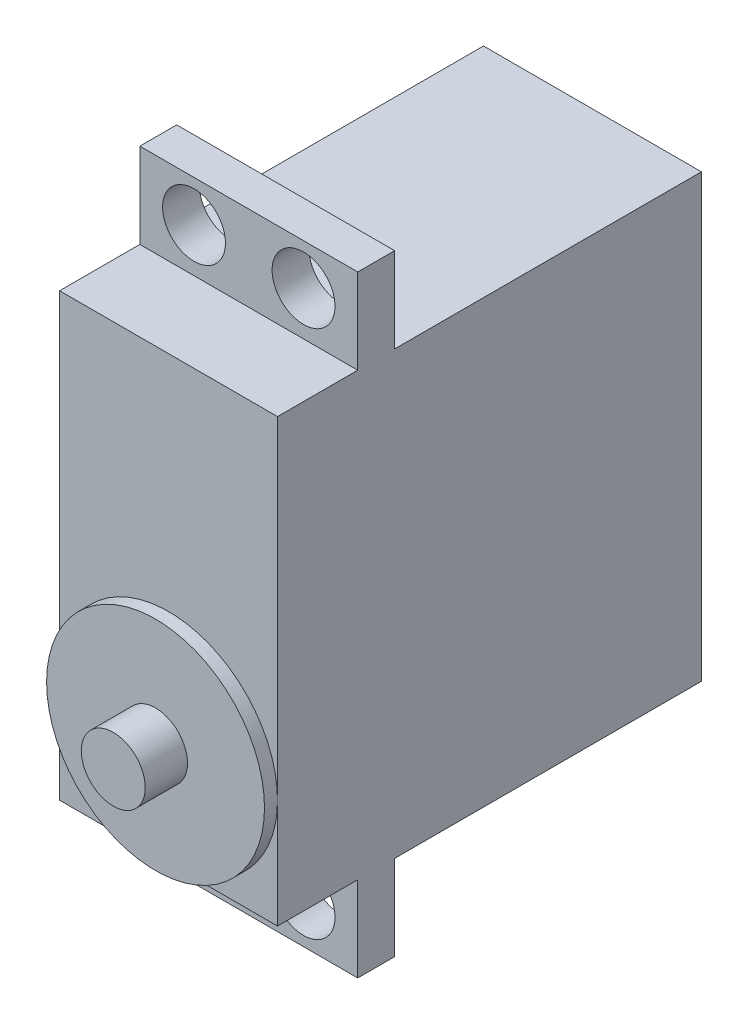
ISO-10303-21;
HEADER;
FILE_DESCRIPTION(('STEP AP214'),'2;1');
FILE_NAME('part.step','',(''),(''),'','','');
FILE_SCHEMA(('AUTOMOTIVE_DESIGN { 1 0 10303 214 1 1 1 1 }'));
ENDSEC;
DATA;
#1=APPLICATION_CONTEXT('core data for automotive mechanical design processes');
#2=APPLICATION_PROTOCOL_DEFINITION('international standard','automotive_design',2000,#1);
#3=PRODUCT_CONTEXT('',#1,'mechanical');
#4=PRODUCT('Part','Part','',(#3));
#5=PRODUCT_RELATED_PRODUCT_CATEGORY('part','',(#4));
#6=PRODUCT_DEFINITION_FORMATION('','',#4);
#7=PRODUCT_DEFINITION_CONTEXT('part definition',#1,'design');
#8=PRODUCT_DEFINITION('design','',#6,#7);
#9=PRODUCT_DEFINITION_SHAPE('','',#8);
#10=(LENGTH_UNIT() NAMED_UNIT(*) SI_UNIT(.MILLI.,.METRE.));
#11=(NAMED_UNIT(*) PLANE_ANGLE_UNIT() SI_UNIT($,.RADIAN.));
#12=(NAMED_UNIT(*) SI_UNIT($,.STERADIAN.) SOLID_ANGLE_UNIT());
#13=UNCERTAINTY_MEASURE_WITH_UNIT(LENGTH_MEASURE(1.E-05),#10,'distance_accuracy_value','');
#14=(GEOMETRIC_REPRESENTATION_CONTEXT(3) GLOBAL_UNCERTAINTY_ASSIGNED_CONTEXT((#13)) GLOBAL_UNIT_ASSIGNED_CONTEXT((#10,
#11,#12)) REPRESENTATION_CONTEXT('',''));
#15=CARTESIAN_POINT('',(0.,0.,0.));
#16=DIRECTION('',(0.,0.,1.));
#17=DIRECTION('',(1.,0.,0.));
#18=AXIS2_PLACEMENT_3D('',#15,#16,#17);
#19=CARTESIAN_POINT('',(-10.05,20.35,0.));
#20=DIRECTION('',(0.,1.,0.));
#21=DIRECTION('',(0.,0.,1.));
#22=AXIS2_PLACEMENT_3D('',#19,#20,#21);
#23=PLANE('',#22);
#24=DIRECTION('',(0.,0.,-1.));
#25=VECTOR('',#24,1.);
#26=CARTESIAN_POINT('',(10.05,20.35,0.));
#27=LINE('',#26,#25);
#28=CARTESIAN_POINT('',(10.05,20.35,0.));
#29=VERTEX_POINT('',#28);
#30=CARTESIAN_POINT('',(10.05,20.35,-7.4));
#31=VERTEX_POINT('',#30);
#32=EDGE_CURVE('E284',#29,#31,#27,.T.);
#33=ORIENTED_EDGE('',*,*,#32,.T.);
#34=DIRECTION('',(-1.,0.,0.));
#35=VECTOR('',#34,1.);
#36=CARTESIAN_POINT('',(0.,20.35,-7.4));
#37=LINE('',#36,#35);
#38=CARTESIAN_POINT('',(-10.05,20.35,-7.4));
#39=VERTEX_POINT('',#38);
#40=EDGE_CURVE('E184',#31,#39,#37,.T.);
#41=ORIENTED_EDGE('',*,*,#40,.T.);
#42=DIRECTION('',(0.,0.,-1.));
#43=VECTOR('',#42,1.);
#44=CARTESIAN_POINT('',(-10.05,20.35,0.));
#45=LINE('',#44,#43);
#46=CARTESIAN_POINT('',(-10.05,20.35,0.));
#47=VERTEX_POINT('',#46);
#48=EDGE_CURVE('E347',#47,#39,#45,.T.);
#49=ORIENTED_EDGE('',*,*,#48,.F.);
#50=DIRECTION('',(1.,0.,0.));
#51=VECTOR('',#50,1.);
#52=CARTESIAN_POINT('',(-10.05,20.35,0.));
#53=LINE('',#52,#51);
#54=EDGE_CURVE('E295',#47,#29,#53,.T.);
#55=ORIENTED_EDGE('',*,*,#54,.T.);
#56=EDGE_LOOP('',(#33,#41,#49,#55));
#57=FACE_BOUND('',#56,.T.);
#58=ADVANCED_FACE('F74',(#57),#23,.T.);
#59=CARTESIAN_POINT('',(-10.05,20.35,-10.8));
#60=VERTEX_POINT('',#59);
#61=CARTESIAN_POINT('',(-10.05,20.35,-39.1));
#62=VERTEX_POINT('',#61);
#63=EDGE_CURVE('E300',#60,#62,#45,.T.);
#64=ORIENTED_EDGE('',*,*,#63,.F.);
#65=DIRECTION('',(1.,0.,0.));
#66=VECTOR('',#65,1.);
#67=CARTESIAN_POINT('',(0.,20.35,-10.8));
#68=LINE('',#67,#66);
#69=CARTESIAN_POINT('',(10.05,20.35,-10.8));
#70=VERTEX_POINT('',#69);
#71=EDGE_CURVE('E201',#60,#70,#68,.T.);
#72=ORIENTED_EDGE('',*,*,#71,.T.);
#73=CARTESIAN_POINT('',(10.05,20.35,-39.1));
#74=VERTEX_POINT('',#73);
#75=EDGE_CURVE('E78',#70,#74,#27,.T.);
#76=ORIENTED_EDGE('',*,*,#75,.T.);
#77=DIRECTION('',(1.,0.,0.));
#78=VECTOR('',#77,1.);
#79=CARTESIAN_POINT('',(-10.05,20.35,-39.1));
#80=LINE('',#79,#78);
#81=EDGE_CURVE('E291',#62,#74,#80,.T.);
#82=ORIENTED_EDGE('',*,*,#81,.F.);
#83=EDGE_LOOP('',(#64,#72,#76,#82));
#84=FACE_BOUND('',#83,.T.);
#85=ADVANCED_FACE('F343',(#84),#23,.T.);
#86=CARTESIAN_POINT('',(-10.05,-20.35,0.));
#87=DIRECTION('',(0.,1.,0.));
#88=DIRECTION('',(0.,0.,1.));
#89=AXIS2_PLACEMENT_3D('',#86,#87,#88);
#90=PLANE('',#89);
#91=DIRECTION('',(-1.,0.,0.));
#92=VECTOR('',#91,1.);
#93=CARTESIAN_POINT('',(0.,-20.35,-7.4));
#94=LINE('',#93,#92);
#95=CARTESIAN_POINT('',(10.05,-20.35,-7.4));
#96=VERTEX_POINT('',#95);
#97=CARTESIAN_POINT('',(-10.05,-20.35,-7.4));
#98=VERTEX_POINT('',#97);
#99=EDGE_CURVE('E187',#96,#98,#94,.T.);
#100=ORIENTED_EDGE('',*,*,#99,.F.);
#101=DIRECTION('',(0.,0.,-1.));
#102=VECTOR('',#101,1.);
#103=CARTESIAN_POINT('',(10.05,-20.35,0.));
#104=LINE('',#103,#102);
#105=CARTESIAN_POINT('',(10.05,-20.35,0.));
#106=VERTEX_POINT('',#105);
#107=EDGE_CURVE('E259',#106,#96,#104,.T.);
#108=ORIENTED_EDGE('',*,*,#107,.F.);
#109=DIRECTION('',(1.,0.,0.));
#110=VECTOR('',#109,1.);
#111=CARTESIAN_POINT('',(-10.05,-20.35,0.));
#112=LINE('',#111,#110);
#113=CARTESIAN_POINT('',(0.,-20.35,0.));
#114=VERTEX_POINT('',#113);
#115=EDGE_CURVE('E270',#114,#106,#112,.T.);
#116=ORIENTED_EDGE('',*,*,#115,.F.);
#117=CARTESIAN_POINT('',(-10.05,-20.35,0.));
#118=VERTEX_POINT('',#117);
#119=EDGE_CURVE('E260',#118,#114,#112,.T.);
#120=ORIENTED_EDGE('',*,*,#119,.F.);
#121=DIRECTION('',(0.,0.,-1.));
#122=VECTOR('',#121,1.);
#123=CARTESIAN_POINT('',(-10.05,-20.35,0.));
#124=LINE('',#123,#122);
#125=EDGE_CURVE('E319',#118,#98,#124,.T.);
#126=ORIENTED_EDGE('',*,*,#125,.T.);
#127=EDGE_LOOP('',(#100,#108,#116,#120,#126));
#128=FACE_BOUND('',#127,.T.);
#129=ADVANCED_FACE('F315',(#128),#90,.F.);
#130=DIRECTION('',(1.,0.,0.));
#131=VECTOR('',#130,1.);
#132=CARTESIAN_POINT('',(0.,-20.35,-10.8));
#133=LINE('',#132,#131);
#134=CARTESIAN_POINT('',(-10.05,-20.35,-10.8));
#135=VERTEX_POINT('',#134);
#136=CARTESIAN_POINT('',(10.05,-20.35,-10.8));
#137=VERTEX_POINT('',#136);
#138=EDGE_CURVE('E221',#135,#137,#133,.T.);
#139=ORIENTED_EDGE('',*,*,#138,.F.);
#140=CARTESIAN_POINT('',(-10.05,-20.35,-39.1));
#141=VERTEX_POINT('',#140);
#142=EDGE_CURVE('E261',#135,#141,#124,.T.);
#143=ORIENTED_EDGE('',*,*,#142,.T.);
#144=DIRECTION('',(1.,0.,0.));
#145=VECTOR('',#144,1.);
#146=CARTESIAN_POINT('',(-10.05,-20.35,-39.1));
#147=LINE('',#146,#145);
#148=CARTESIAN_POINT('',(10.05,-20.35,-39.1));
#149=VERTEX_POINT('',#148);
#150=EDGE_CURVE('E273',#141,#149,#147,.T.);
#151=ORIENTED_EDGE('',*,*,#150,.T.);
#152=EDGE_CURVE('E256',#137,#149,#104,.T.);
#153=ORIENTED_EDGE('',*,*,#152,.F.);
#154=EDGE_LOOP('',(#139,#143,#151,#153));
#155=FACE_BOUND('',#154,.T.);
#156=ADVANCED_FACE('F338',(#155),#90,.F.);
#157=CARTESIAN_POINT('',(0.,0.,0.));
#158=DIRECTION('',(0.,0.,-1.));
#159=DIRECTION('',(-1.,0.,0.));
#160=AXIS2_PLACEMENT_3D('',#157,#158,#159);
#161=PLANE('',#160);
#162=CARTESIAN_POINT('',(0.,-10.3,0.));
#163=DIRECTION('',(0.,0.,1.));
#164=DIRECTION('',(1.,0.,0.));
#165=AXIS2_PLACEMENT_3D('',#162,#163,#164);
#166=CIRCLE('',#165,10.05);
#167=CARTESIAN_POINT('',(10.05,-10.3,0.));
#168=VERTEX_POINT('',#167);
#169=CARTESIAN_POINT('',(-10.05,-10.3,0.));
#170=VERTEX_POINT('',#169);
#171=EDGE_CURVE('E239',#168,#170,#166,.T.);
#172=ORIENTED_EDGE('',*,*,#171,.F.);
#173=DIRECTION('',(0.,-1.,0.));
#174=VECTOR('',#173,1.);
#175=CARTESIAN_POINT('',(10.05,20.35,0.));
#176=LINE('',#175,#174);
#177=EDGE_CURVE('E283',#29,#168,#176,.T.);
#178=ORIENTED_EDGE('',*,*,#177,.F.);
#179=ORIENTED_EDGE('',*,*,#54,.F.);
#180=DIRECTION('',(0.,-1.,0.));
#181=VECTOR('',#180,1.);
#182=CARTESIAN_POINT('',(-10.05,20.35,0.));
#183=LINE('',#182,#181);
#184=EDGE_CURVE('E359',#47,#170,#183,.T.);
#185=ORIENTED_EDGE('',*,*,#184,.T.);
#186=EDGE_LOOP('',(#172,#178,#179,#185));
#187=FACE_BOUND('',#186,.T.);
#188=ADVANCED_FACE('F358',(#187),#161,.F.);
#189=EDGE_CURVE('E84',#170,#114,#166,.T.);
#190=ORIENTED_EDGE('',*,*,#189,.F.);
#191=EDGE_CURVE('E279',#170,#118,#183,.T.);
#192=ORIENTED_EDGE('',*,*,#191,.T.);
#193=ORIENTED_EDGE('',*,*,#119,.T.);
#194=EDGE_LOOP('',(#190,#192,#193));
#195=FACE_BOUND('',#194,.T.);
#196=ADVANCED_FACE('F375',(#195),#161,.F.);
#197=CARTESIAN_POINT('',(0.,0.,-39.1));
#198=DIRECTION('',(0.,0.,-1.));
#199=DIRECTION('',(-1.,0.,0.));
#200=AXIS2_PLACEMENT_3D('',#197,#198,#199);
#201=PLANE('',#200);
#202=DIRECTION('',(0.,-1.,0.));
#203=VECTOR('',#202,1.);
#204=CARTESIAN_POINT('',(-10.05,20.35,-39.1));
#205=LINE('',#204,#203);
#206=EDGE_CURVE('E244',#62,#141,#205,.T.);
#207=ORIENTED_EDGE('',*,*,#206,.F.);
#208=ORIENTED_EDGE('',*,*,#81,.T.);
#209=DIRECTION('',(0.,-1.,0.));
#210=VECTOR('',#209,1.);
#211=CARTESIAN_POINT('',(10.05,20.35,-39.1));
#212=LINE('',#211,#210);
#213=EDGE_CURVE('E303',#74,#149,#212,.T.);
#214=ORIENTED_EDGE('',*,*,#213,.T.);
#215=ORIENTED_EDGE('',*,*,#150,.F.);
#216=EDGE_LOOP('',(#207,#208,#214,#215));
#217=FACE_BOUND('',#216,.T.);
#218=ADVANCED_FACE('F76',(#217),#201,.T.);
#219=EDGE_CURVE('E251',#114,#168,#166,.T.);
#220=ORIENTED_EDGE('',*,*,#219,.F.);
#221=ORIENTED_EDGE('',*,*,#115,.T.);
#222=EDGE_CURVE('E281',#168,#106,#176,.T.);
#223=ORIENTED_EDGE('',*,*,#222,.F.);
#224=EDGE_LOOP('',(#220,#221,#223));
#225=FACE_BOUND('',#224,.T.);
#226=ADVANCED_FACE('F354',(#225),#161,.F.);
#227=CARTESIAN_POINT('',(-10.05,20.35,0.));
#228=DIRECTION('',(1.,0.,0.));
#229=DIRECTION('',(0.,0.,-1.));
#230=AXIS2_PLACEMENT_3D('',#227,#228,#229);
#231=PLANE('',#230);
#232=ORIENTED_EDGE('',*,*,#206,.T.);
#233=ORIENTED_EDGE('',*,*,#142,.F.);
#234=DIRECTION('',(0.,1.,0.));
#235=VECTOR('',#234,1.);
#236=CARTESIAN_POINT('',(-10.05,-28.2,-10.8));
#237=LINE('',#236,#235);
#238=CARTESIAN_POINT('',(-10.05,-28.2,-10.8));
#239=VERTEX_POINT('',#238);
#240=EDGE_CURVE('E230',#239,#135,#237,.T.);
#241=ORIENTED_EDGE('',*,*,#240,.F.);
#242=DIRECTION('',(0.,0.,-1.));
#243=VECTOR('',#242,1.);
#244=CARTESIAN_POINT('',(-10.05,-28.2,0.));
#245=LINE('',#244,#243);
#246=CARTESIAN_POINT('',(-10.05,-28.2,-7.4));
#247=VERTEX_POINT('',#246);
#248=EDGE_CURVE('E223',#247,#239,#245,.T.);
#249=ORIENTED_EDGE('',*,*,#248,.F.);
#250=DIRECTION('',(0.,1.,0.));
#251=VECTOR('',#250,1.);
#252=CARTESIAN_POINT('',(-10.05,-28.2,-7.4));
#253=LINE('',#252,#251);
#254=EDGE_CURVE('E232',#247,#98,#253,.T.);
#255=ORIENTED_EDGE('',*,*,#254,.T.);
#256=ORIENTED_EDGE('',*,*,#125,.F.);
#257=ORIENTED_EDGE('',*,*,#191,.F.);
#258=ORIENTED_EDGE('',*,*,#184,.F.);
#259=ORIENTED_EDGE('',*,*,#48,.T.);
#260=DIRECTION('',(0.,-1.,0.));
#261=VECTOR('',#260,1.);
#262=CARTESIAN_POINT('',(-10.05,28.2,-7.4));
#263=LINE('',#262,#261);
#264=CARTESIAN_POINT('',(-10.05,28.2,-7.4));
#265=VERTEX_POINT('',#264);
#266=EDGE_CURVE('E210',#265,#39,#263,.T.);
#267=ORIENTED_EDGE('',*,*,#266,.F.);
#268=DIRECTION('',(0.,0.,1.));
#269=VECTOR('',#268,1.);
#270=CARTESIAN_POINT('',(-10.05,28.2,0.));
#271=LINE('',#270,#269);
#272=CARTESIAN_POINT('',(-10.05,28.2,-10.8));
#273=VERTEX_POINT('',#272);
#274=EDGE_CURVE('E199',#273,#265,#271,.T.);
#275=ORIENTED_EDGE('',*,*,#274,.F.);
#276=DIRECTION('',(0.,-1.,0.));
#277=VECTOR('',#276,1.);
#278=CARTESIAN_POINT('',(-10.05,28.2,-10.8));
#279=LINE('',#278,#277);
#280=EDGE_CURVE('E214',#273,#60,#279,.T.);
#281=ORIENTED_EDGE('',*,*,#280,.T.);
#282=ORIENTED_EDGE('',*,*,#63,.T.);
#283=EDGE_LOOP('',(#232,#233,#241,#249,#255,#256,#257,#258,#259,#267,#275,#281,#282));
#284=FACE_BOUND('',#283,.T.);
#285=ADVANCED_FACE('F325',(#284),#231,.F.);
#286=CARTESIAN_POINT('',(10.05,20.35,0.));
#287=DIRECTION('',(1.,0.,0.));
#288=DIRECTION('',(0.,0.,-1.));
#289=AXIS2_PLACEMENT_3D('',#286,#287,#288);
#290=PLANE('',#289);
#291=ORIENTED_EDGE('',*,*,#213,.F.);
#292=ORIENTED_EDGE('',*,*,#75,.F.);
#293=DIRECTION('',(0.,-1.,0.));
#294=VECTOR('',#293,1.);
#295=CARTESIAN_POINT('',(10.05,28.2,-10.8));
#296=LINE('',#295,#294);
#297=CARTESIAN_POINT('',(10.05,28.2,-10.8));
#298=VERTEX_POINT('',#297);
#299=EDGE_CURVE('E92',#298,#70,#296,.T.);
#300=ORIENTED_EDGE('',*,*,#299,.F.);
#301=DIRECTION('',(0.,0.,-1.));
#302=VECTOR('',#301,1.);
#303=CARTESIAN_POINT('',(10.05,28.2,0.));
#304=LINE('',#303,#302);
#305=CARTESIAN_POINT('',(10.05,28.2,-7.4));
#306=VERTEX_POINT('',#305);
#307=EDGE_CURVE('E189',#306,#298,#304,.T.);
#308=ORIENTED_EDGE('',*,*,#307,.F.);
#309=DIRECTION('',(0.,-1.,0.));
#310=VECTOR('',#309,1.);
#311=CARTESIAN_POINT('',(10.05,28.2,-7.4));
#312=LINE('',#311,#310);
#313=EDGE_CURVE('E178',#306,#31,#312,.T.);
#314=ORIENTED_EDGE('',*,*,#313,.T.);
#315=ORIENTED_EDGE('',*,*,#32,.F.);
#316=ORIENTED_EDGE('',*,*,#177,.T.);
#317=ORIENTED_EDGE('',*,*,#222,.T.);
#318=ORIENTED_EDGE('',*,*,#107,.T.);
#319=DIRECTION('',(0.,1.,0.));
#320=VECTOR('',#319,1.);
#321=CARTESIAN_POINT('',(10.05,-28.2,-7.4));
#322=LINE('',#321,#320);
#323=CARTESIAN_POINT('',(10.05,-28.2,-7.4));
#324=VERTEX_POINT('',#323);
#325=EDGE_CURVE('E235',#324,#96,#322,.T.);
#326=ORIENTED_EDGE('',*,*,#325,.F.);
#327=DIRECTION('',(0.,0.,1.));
#328=VECTOR('',#327,1.);
#329=CARTESIAN_POINT('',(10.05,-28.2,0.));
#330=LINE('',#329,#328);
#331=CARTESIAN_POINT('',(10.05,-28.2,-10.8));
#332=VERTEX_POINT('',#331);
#333=EDGE_CURVE('E217',#332,#324,#330,.T.);
#334=ORIENTED_EDGE('',*,*,#333,.F.);
#335=DIRECTION('',(0.,1.,0.));
#336=VECTOR('',#335,1.);
#337=CARTESIAN_POINT('',(10.05,-28.2,-10.8));
#338=LINE('',#337,#336);
#339=EDGE_CURVE('E100',#332,#137,#338,.T.);
#340=ORIENTED_EDGE('',*,*,#339,.T.);
#341=ORIENTED_EDGE('',*,*,#152,.T.);
#342=EDGE_LOOP('',(#291,#292,#300,#308,#314,#315,#316,#317,#318,#326,#334,#340,#341));
#343=FACE_BOUND('',#342,.T.);
#344=ADVANCED_FACE('F191',(#343),#290,.T.);
#345=CARTESIAN_POINT('',(0.,-10.3,1.2));
#346=DIRECTION('',(0.,0.,-1.));
#347=DIRECTION('',(-1.,0.,0.));
#348=AXIS2_PLACEMENT_3D('',#345,#346,#347);
#349=CYLINDRICAL_SURFACE('',#348,10.05);
#350=CARTESIAN_POINT('',(0.,-10.3,1.2));
#351=DIRECTION('',(0.,0.,1.));
#352=DIRECTION('',(1.,0.,0.));
#353=AXIS2_PLACEMENT_3D('',#350,#351,#352);
#354=CIRCLE('',#353,10.05);
#355=CARTESIAN_POINT('',(10.05,-10.3,1.2));
#356=VERTEX_POINT('',#355);
#357=EDGE_CURVE('E241',#356,#356,#354,.T.);
#358=ORIENTED_EDGE('',*,*,#357,.F.);
#359=EDGE_LOOP('',(#358));
#360=FACE_BOUND('',#359,.T.);
#361=ORIENTED_EDGE('',*,*,#171,.T.);
#362=ORIENTED_EDGE('',*,*,#189,.T.);
#363=ORIENTED_EDGE('',*,*,#219,.T.);
#364=EDGE_LOOP('',(#361,#362,#363));
#365=FACE_BOUND('',#364,.T.);
#366=ADVANCED_FACE('F361',(#360,#365),#349,.T.);
#367=CARTESIAN_POINT('',(0.,0.,1.2));
#368=DIRECTION('',(0.,0.,1.));
#369=DIRECTION('',(1.,0.,0.));
#370=AXIS2_PLACEMENT_3D('',#367,#368,#369);
#371=PLANE('',#370);
#372=CARTESIAN_POINT('',(0.,-10.3,1.2));
#373=DIRECTION('',(0.,0.,1.));
#374=DIRECTION('',(1.,0.,0.));
#375=AXIS2_PLACEMENT_3D('',#372,#373,#374);
#376=CIRCLE('',#375,2.95);
#377=CARTESIAN_POINT('',(2.95,-10.3,1.2));
#378=VERTEX_POINT('',#377);
#379=EDGE_CURVE('E12',#378,#378,#376,.T.);
#380=ORIENTED_EDGE('',*,*,#379,.F.);
#381=EDGE_LOOP('',(#380));
#382=FACE_BOUND('',#381,.T.);
#383=ORIENTED_EDGE('',*,*,#357,.T.);
#384=EDGE_LOOP('',(#383));
#385=FACE_BOUND('',#384,.T.);
#386=ADVANCED_FACE('F396',(#382,#385),#371,.T.);
#387=CARTESIAN_POINT('',(0.,-10.3,5.1));
#388=DIRECTION('',(0.,0.,-1.));
#389=DIRECTION('',(-1.,0.,0.));
#390=AXIS2_PLACEMENT_3D('',#387,#388,#389);
#391=CYLINDRICAL_SURFACE('',#390,2.95);
#392=CARTESIAN_POINT('',(0.,-10.3,5.1));
#393=DIRECTION('',(0.,0.,1.));
#394=DIRECTION('',(1.,0.,0.));
#395=AXIS2_PLACEMENT_3D('',#392,#393,#394);
#396=CIRCLE('',#395,2.95);
#397=CARTESIAN_POINT('',(2.95,-10.3,5.1));
#398=VERTEX_POINT('',#397);
#399=EDGE_CURVE('E237',#398,#398,#396,.T.);
#400=ORIENTED_EDGE('',*,*,#399,.F.);
#401=EDGE_LOOP('',(#400));
#402=FACE_BOUND('',#401,.T.);
#403=ORIENTED_EDGE('',*,*,#379,.T.);
#404=EDGE_LOOP('',(#403));
#405=FACE_BOUND('',#404,.T.);
#406=ADVANCED_FACE('F400',(#402,#405),#391,.T.);
#407=CARTESIAN_POINT('',(0.,-10.3,5.1));
#408=DIRECTION('',(0.,0.,1.));
#409=DIRECTION('',(1.,0.,0.));
#410=AXIS2_PLACEMENT_3D('',#407,#408,#409);
#411=PLANE('',#410);
#412=ORIENTED_EDGE('',*,*,#399,.T.);
#413=EDGE_LOOP('',(#412));
#414=FACE_BOUND('',#413,.T.);
#415=ADVANCED_FACE('F404',(#414),#411,.T.);
#416=CARTESIAN_POINT('',(0.,-28.2,-7.4));
#417=DIRECTION('',(0.,0.,-1.));
#418=DIRECTION('',(-1.,0.,0.));
#419=AXIS2_PLACEMENT_3D('',#416,#417,#418);
#420=PLANE('',#419);
#421=CARTESIAN_POINT('',(-5.05,-24.4,-7.4));
#422=DIRECTION('',(0.,0.,1.));
#423=DIRECTION('',(1.,0.,0.));
#424=AXIS2_PLACEMENT_3D('',#421,#422,#423);
#425=CIRCLE('',#424,2.9);
#426=CARTESIAN_POINT('',(-2.15,-24.4,-7.4));
#427=VERTEX_POINT('',#426);
#428=EDGE_CURVE('E460',#427,#427,#425,.T.);
#429=ORIENTED_EDGE('',*,*,#428,.F.);
#430=EDGE_LOOP('',(#429));
#431=FACE_BOUND('',#430,.T.);
#432=CARTESIAN_POINT('',(5.05,-24.4,-7.4));
#433=DIRECTION('',(0.,0.,1.));
#434=DIRECTION('',(1.,0.,0.));
#435=AXIS2_PLACEMENT_3D('',#432,#433,#434);
#436=CIRCLE('',#435,2.9);
#437=CARTESIAN_POINT('',(7.95,-24.4,-7.4));
#438=VERTEX_POINT('',#437);
#439=EDGE_CURVE('E449',#438,#438,#436,.T.);
#440=ORIENTED_EDGE('',*,*,#439,.F.);
#441=EDGE_LOOP('',(#440));
#442=FACE_BOUND('',#441,.T.);
#443=ORIENTED_EDGE('',*,*,#99,.T.);
#444=ORIENTED_EDGE('',*,*,#254,.F.);
#445=DIRECTION('',(-1.,0.,0.));
#446=VECTOR('',#445,1.);
#447=CARTESIAN_POINT('',(0.,-28.2,-7.4));
#448=LINE('',#447,#446);
#449=EDGE_CURVE('E220',#324,#247,#448,.T.);
#450=ORIENTED_EDGE('',*,*,#449,.F.);
#451=ORIENTED_EDGE('',*,*,#325,.T.);
#452=EDGE_LOOP('',(#443,#444,#450,#451));
#453=FACE_BOUND('',#452,.T.);
#454=ADVANCED_FACE('F322',(#431,#442,#453),#420,.F.);
#455=CARTESIAN_POINT('',(0.,-28.2,-10.8));
#456=DIRECTION('',(0.,0.,1.));
#457=DIRECTION('',(1.,0.,0.));
#458=AXIS2_PLACEMENT_3D('',#455,#456,#457);
#459=PLANE('',#458);
#460=CARTESIAN_POINT('',(-5.05,-24.4,-10.8));
#461=DIRECTION('',(0.,0.,1.));
#462=DIRECTION('',(1.,0.,0.));
#463=AXIS2_PLACEMENT_3D('',#460,#461,#462);
#464=CIRCLE('',#463,2.9);
#465=CARTESIAN_POINT('',(-2.15,-24.4,-10.8));
#466=VERTEX_POINT('',#465);
#467=EDGE_CURVE('E211',#466,#466,#464,.F.);
#468=ORIENTED_EDGE('',*,*,#467,.F.);
#469=EDGE_LOOP('',(#468));
#470=FACE_BOUND('',#469,.T.);
#471=CARTESIAN_POINT('',(5.05,-24.4,-10.8));
#472=DIRECTION('',(0.,0.,1.));
#473=DIRECTION('',(1.,0.,0.));
#474=AXIS2_PLACEMENT_3D('',#471,#472,#473);
#475=CIRCLE('',#474,2.9);
#476=CARTESIAN_POINT('',(7.95,-24.4,-10.8));
#477=VERTEX_POINT('',#476);
#478=EDGE_CURVE('E205',#477,#477,#475,.F.);
#479=ORIENTED_EDGE('',*,*,#478,.F.);
#480=EDGE_LOOP('',(#479));
#481=FACE_BOUND('',#480,.T.);
#482=ORIENTED_EDGE('',*,*,#138,.T.);
#483=ORIENTED_EDGE('',*,*,#339,.F.);
#484=DIRECTION('',(1.,0.,0.));
#485=VECTOR('',#484,1.);
#486=CARTESIAN_POINT('',(0.,-28.2,-10.8));
#487=LINE('',#486,#485);
#488=EDGE_CURVE('E225',#239,#332,#487,.T.);
#489=ORIENTED_EDGE('',*,*,#488,.F.);
#490=ORIENTED_EDGE('',*,*,#240,.T.);
#491=EDGE_LOOP('',(#482,#483,#489,#490));
#492=FACE_BOUND('',#491,.T.);
#493=ADVANCED_FACE('F333',(#470,#481,#492),#459,.F.);
#494=CARTESIAN_POINT('',(0.,-28.2,0.));
#495=DIRECTION('',(0.,-1.,0.));
#496=DIRECTION('',(0.,0.,-1.));
#497=AXIS2_PLACEMENT_3D('',#494,#495,#496);
#498=PLANE('',#497);
#499=ORIENTED_EDGE('',*,*,#333,.T.);
#500=ORIENTED_EDGE('',*,*,#449,.T.);
#501=ORIENTED_EDGE('',*,*,#248,.T.);
#502=ORIENTED_EDGE('',*,*,#488,.T.);
#503=EDGE_LOOP('',(#499,#500,#501,#502));
#504=FACE_BOUND('',#503,.T.);
#505=ADVANCED_FACE('F331',(#504),#498,.T.);
#506=CARTESIAN_POINT('',(0.,28.2,-7.4));
#507=DIRECTION('',(0.,0.,1.));
#508=DIRECTION('',(1.,0.,0.));
#509=AXIS2_PLACEMENT_3D('',#506,#507,#508);
#510=PLANE('',#509);
#511=CARTESIAN_POINT('',(-5.05,24.4,-7.4));
#512=DIRECTION('',(0.,0.,1.));
#513=DIRECTION('',(1.,0.,0.));
#514=AXIS2_PLACEMENT_3D('',#511,#512,#513);
#515=CIRCLE('',#514,2.9);
#516=CARTESIAN_POINT('',(-2.15,24.4,-7.4));
#517=VERTEX_POINT('',#516);
#518=EDGE_CURVE('E448',#517,#517,#515,.T.);
#519=ORIENTED_EDGE('',*,*,#518,.F.);
#520=EDGE_LOOP('',(#519));
#521=FACE_BOUND('',#520,.T.);
#522=CARTESIAN_POINT('',(5.05,24.4,-7.4));
#523=DIRECTION('',(0.,0.,1.));
#524=DIRECTION('',(1.,0.,0.));
#525=AXIS2_PLACEMENT_3D('',#522,#523,#524);
#526=CIRCLE('',#525,2.9);
#527=CARTESIAN_POINT('',(7.95,24.4,-7.4));
#528=VERTEX_POINT('',#527);
#529=EDGE_CURVE('E452',#528,#528,#526,.T.);
#530=ORIENTED_EDGE('',*,*,#529,.F.);
#531=EDGE_LOOP('',(#530));
#532=FACE_BOUND('',#531,.T.);
#533=ORIENTED_EDGE('',*,*,#40,.F.);
#534=ORIENTED_EDGE('',*,*,#313,.F.);
#535=DIRECTION('',(-1.,0.,0.));
#536=VECTOR('',#535,1.);
#537=CARTESIAN_POINT('',(0.,28.2,-7.4));
#538=LINE('',#537,#536);
#539=EDGE_CURVE('E182',#306,#265,#538,.T.);
#540=ORIENTED_EDGE('',*,*,#539,.T.);
#541=ORIENTED_EDGE('',*,*,#266,.T.);
#542=EDGE_LOOP('',(#533,#534,#540,#541));
#543=FACE_BOUND('',#542,.T.);
#544=ADVANCED_FACE('F180',(#521,#532,#543),#510,.T.);
#545=CARTESIAN_POINT('',(0.,28.2,-10.8));
#546=DIRECTION('',(0.,0.,-1.));
#547=DIRECTION('',(-1.,0.,0.));
#548=AXIS2_PLACEMENT_3D('',#545,#546,#547);
#549=PLANE('',#548);
#550=CARTESIAN_POINT('',(-5.05,24.4,-10.8));
#551=DIRECTION('',(0.,0.,-1.));
#552=DIRECTION('',(-1.,0.,0.));
#553=AXIS2_PLACEMENT_3D('',#550,#551,#552);
#554=CIRCLE('',#553,2.9);
#555=CARTESIAN_POINT('',(-7.95,24.4,-10.8));
#556=VERTEX_POINT('',#555);
#557=EDGE_CURVE('E445',#556,#556,#554,.F.);
#558=ORIENTED_EDGE('',*,*,#557,.T.);
#559=EDGE_LOOP('',(#558));
#560=FACE_BOUND('',#559,.T.);
#561=CARTESIAN_POINT('',(5.05,24.4,-10.8));
#562=DIRECTION('',(0.,0.,-1.));
#563=DIRECTION('',(-1.,0.,0.));
#564=AXIS2_PLACEMENT_3D('',#561,#562,#563);
#565=CIRCLE('',#564,2.9);
#566=CARTESIAN_POINT('',(2.15,24.4,-10.8));
#567=VERTEX_POINT('',#566);
#568=EDGE_CURVE('E457',#567,#567,#565,.F.);
#569=ORIENTED_EDGE('',*,*,#568,.T.);
#570=EDGE_LOOP('',(#569));
#571=FACE_BOUND('',#570,.T.);
#572=ORIENTED_EDGE('',*,*,#71,.F.);
#573=ORIENTED_EDGE('',*,*,#280,.F.);
#574=DIRECTION('',(1.,0.,0.));
#575=VECTOR('',#574,1.);
#576=CARTESIAN_POINT('',(0.,28.2,-10.8));
#577=LINE('',#576,#575);
#578=EDGE_CURVE('E195',#273,#298,#577,.T.);
#579=ORIENTED_EDGE('',*,*,#578,.T.);
#580=ORIENTED_EDGE('',*,*,#299,.T.);
#581=EDGE_LOOP('',(#572,#573,#579,#580));
#582=FACE_BOUND('',#581,.T.);
#583=ADVANCED_FACE('F344',(#560,#571,#582),#549,.T.);
#584=CARTESIAN_POINT('',(0.,28.2,0.));
#585=DIRECTION('',(0.,1.,0.));
#586=DIRECTION('',(0.,0.,1.));
#587=AXIS2_PLACEMENT_3D('',#584,#585,#586);
#588=PLANE('',#587);
#589=ORIENTED_EDGE('',*,*,#539,.F.);
#590=ORIENTED_EDGE('',*,*,#307,.T.);
#591=ORIENTED_EDGE('',*,*,#578,.F.);
#592=ORIENTED_EDGE('',*,*,#274,.T.);
#593=EDGE_LOOP('',(#589,#590,#591,#592));
#594=FACE_BOUND('',#593,.T.);
#595=ADVANCED_FACE('F197',(#594),#588,.T.);
#596=CARTESIAN_POINT('',(5.05,-24.4,-39.1011030776406));
#597=DIRECTION('',(0.,0.,1.));
#598=DIRECTION('',(1.,0.,0.));
#599=AXIS2_PLACEMENT_3D('',#596,#597,#598);
#600=CYLINDRICAL_SURFACE('',#599,2.9);
#601=ORIENTED_EDGE('',*,*,#439,.T.);
#602=EDGE_LOOP('',(#601));
#603=FACE_BOUND('',#602,.T.);
#604=ORIENTED_EDGE('',*,*,#478,.T.);
#605=EDGE_LOOP('',(#604));
#606=FACE_BOUND('',#605,.T.);
#607=ADVANCED_FACE('F425',(#603,#606),#600,.F.);
#608=CARTESIAN_POINT('',(-5.05,-24.4,-39.1011030776406));
#609=DIRECTION('',(0.,0.,1.));
#610=DIRECTION('',(1.,0.,0.));
#611=AXIS2_PLACEMENT_3D('',#608,#609,#610);
#612=CYLINDRICAL_SURFACE('',#611,2.9);
#613=ORIENTED_EDGE('',*,*,#428,.T.);
#614=EDGE_LOOP('',(#613));
#615=FACE_BOUND('',#614,.T.);
#616=ORIENTED_EDGE('',*,*,#467,.T.);
#617=EDGE_LOOP('',(#616));
#618=FACE_BOUND('',#617,.T.);
#619=ADVANCED_FACE('F428',(#615,#618),#612,.F.);
#620=CARTESIAN_POINT('',(5.05,24.4,-39.1011030776406));
#621=DIRECTION('',(0.,0.,1.));
#622=DIRECTION('',(1.,0.,0.));
#623=AXIS2_PLACEMENT_3D('',#620,#621,#622);
#624=CYLINDRICAL_SURFACE('',#623,2.9);
#625=ORIENTED_EDGE('',*,*,#568,.F.);
#626=EDGE_LOOP('',(#625));
#627=FACE_BOUND('',#626,.T.);
#628=ORIENTED_EDGE('',*,*,#529,.T.);
#629=EDGE_LOOP('',(#628));
#630=FACE_BOUND('',#629,.T.);
#631=ADVANCED_FACE('F432',(#627,#630),#624,.F.);
#632=CARTESIAN_POINT('',(-5.05,24.4,-39.1011030776406));
#633=DIRECTION('',(0.,0.,1.));
#634=DIRECTION('',(1.,0.,0.));
#635=AXIS2_PLACEMENT_3D('',#632,#633,#634);
#636=CYLINDRICAL_SURFACE('',#635,2.9);
#637=ORIENTED_EDGE('',*,*,#557,.F.);
#638=EDGE_LOOP('',(#637));
#639=FACE_BOUND('',#638,.T.);
#640=ORIENTED_EDGE('',*,*,#518,.T.);
#641=EDGE_LOOP('',(#640));
#642=FACE_BOUND('',#641,.T.);
#643=ADVANCED_FACE('F436',(#639,#642),#636,.F.);
#644=CLOSED_SHELL('',(#58,#85,#129,#156,#188,#196,#218,#226,#285,#344,#366,#386,#406,#415,#454,
#493,#505,#544,#583,#595,#607,#619,#631,#643));
#645=MANIFOLD_SOLID_BREP('B2',#644);
#646=ADVANCED_BREP_SHAPE_REPRESENTATION('',(#18,#645),#14);
#647=SHAPE_DEFINITION_REPRESENTATION(#9,#646);
ENDSEC;
END-ISO-10303-21;
